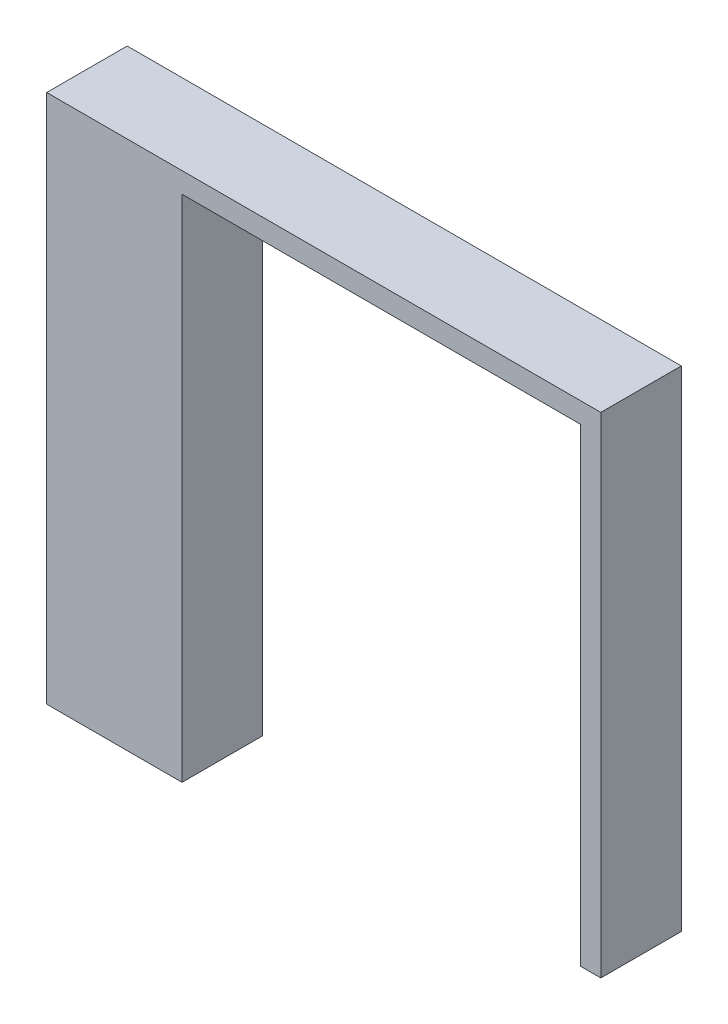
ISO-10303-21;
HEADER;
FILE_DESCRIPTION(('STEP AP214'),'2;1');
FILE_NAME('part.step','',(''),(''),'','','');
FILE_SCHEMA(('AUTOMOTIVE_DESIGN { 1 0 10303 214 1 1 1 1 }'));
ENDSEC;
DATA;
#1=APPLICATION_CONTEXT('core data for automotive mechanical design processes');
#2=APPLICATION_PROTOCOL_DEFINITION('international standard','automotive_design',2000,#1);
#3=PRODUCT_CONTEXT('',#1,'mechanical');
#4=PRODUCT('Part','Part','',(#3));
#5=PRODUCT_RELATED_PRODUCT_CATEGORY('part','',(#4));
#6=PRODUCT_DEFINITION_FORMATION('','',#4);
#7=PRODUCT_DEFINITION_CONTEXT('part definition',#1,'design');
#8=PRODUCT_DEFINITION('design','',#6,#7);
#9=PRODUCT_DEFINITION_SHAPE('','',#8);
#10=(LENGTH_UNIT() NAMED_UNIT(*) SI_UNIT(.MILLI.,.METRE.));
#11=(NAMED_UNIT(*) PLANE_ANGLE_UNIT() SI_UNIT($,.RADIAN.));
#12=(NAMED_UNIT(*) SI_UNIT($,.STERADIAN.) SOLID_ANGLE_UNIT());
#13=UNCERTAINTY_MEASURE_WITH_UNIT(LENGTH_MEASURE(1.E-05),#10,'distance_accuracy_value','');
#14=(GEOMETRIC_REPRESENTATION_CONTEXT(3) GLOBAL_UNCERTAINTY_ASSIGNED_CONTEXT((#13)) GLOBAL_UNIT_ASSIGNED_CONTEXT((#10,
#11,#12)) REPRESENTATION_CONTEXT('',''));
#15=CARTESIAN_POINT('',(0.,0.,0.));
#16=DIRECTION('',(0.,0.,1.));
#17=DIRECTION('',(1.,0.,0.));
#18=AXIS2_PLACEMENT_3D('',#15,#16,#17);
#19=CARTESIAN_POINT('',(7.2263,-5.8674,2.10000088));
#20=DIRECTION('',(0.,0.,-1.));
#21=DIRECTION('',(0.,-1.,0.));
#22=AXIS2_PLACEMENT_3D('',#19,#20,#21);
#23=PLANE('',#22);
#24=DIRECTION('',(0.,1.,0.));
#25=VECTOR('',#24,1.);
#26=CARTESIAN_POINT('',(7.2263,-5.8674,2.10000088));
#27=LINE('',#26,#25);
#28=CARTESIAN_POINT('',(7.2263,-5.8674,2.10000088));
#29=VERTEX_POINT('',#28);
#30=CARTESIAN_POINT('',(7.2263,6.9088,2.10000088));
#31=VERTEX_POINT('',#30);
#32=EDGE_CURVE('E147',#29,#31,#27,.T.);
#33=ORIENTED_EDGE('',*,*,#32,.T.);
#34=DIRECTION('',(-1.,0.,0.));
#35=VECTOR('',#34,1.);
#36=CARTESIAN_POINT('',(7.2263,6.9088,2.10000088));
#37=LINE('',#36,#35);
#38=CARTESIAN_POINT('',(-7.2263,6.9088,2.10000088));
#39=VERTEX_POINT('',#38);
#40=EDGE_CURVE('E137',#31,#39,#37,.T.);
#41=ORIENTED_EDGE('',*,*,#40,.T.);
#42=DIRECTION('',(0.,-1.,0.));
#43=VECTOR('',#42,1.);
#44=CARTESIAN_POINT('',(-7.2263,6.9088,2.10000088));
#45=LINE('',#44,#43);
#46=CARTESIAN_POINT('',(-7.2263,-6.9088,2.10000088));
#47=VERTEX_POINT('',#46);
#48=EDGE_CURVE('E129',#39,#47,#45,.T.);
#49=ORIENTED_EDGE('',*,*,#48,.T.);
#50=DIRECTION('',(1.,0.,0.));
#51=VECTOR('',#50,1.);
#52=CARTESIAN_POINT('',(-7.2263,-6.9088,2.10000088));
#53=LINE('',#52,#51);
#54=CARTESIAN_POINT('',(-3.6957,-6.9088,2.10000088));
#55=VERTEX_POINT('',#54);
#56=EDGE_CURVE('E134',#47,#55,#53,.T.);
#57=ORIENTED_EDGE('',*,*,#56,.T.);
#58=DIRECTION('',(0.,1.,0.));
#59=VECTOR('',#58,1.);
#60=CARTESIAN_POINT('',(-3.6957,-6.9088,2.10000088));
#61=LINE('',#60,#59);
#62=CARTESIAN_POINT('',(-3.6957,6.3754,2.10000088));
#63=VERTEX_POINT('',#62);
#64=EDGE_CURVE('E119',#55,#63,#61,.T.);
#65=ORIENTED_EDGE('',*,*,#64,.T.);
#66=DIRECTION('',(1.,0.,0.));
#67=VECTOR('',#66,1.);
#68=CARTESIAN_POINT('',(-3.6957,6.3754,2.10000088));
#69=LINE('',#68,#67);
#70=CARTESIAN_POINT('',(6.6929,6.3754,2.10000088));
#71=VERTEX_POINT('',#70);
#72=EDGE_CURVE('E105',#63,#71,#69,.T.);
#73=ORIENTED_EDGE('',*,*,#72,.T.);
#74=DIRECTION('',(0.,-1.,0.));
#75=VECTOR('',#74,1.);
#76=CARTESIAN_POINT('',(6.6929,6.3754,2.10000088));
#77=LINE('',#76,#75);
#78=CARTESIAN_POINT('',(6.6929,-5.8674,2.10000088));
#79=VERTEX_POINT('',#78);
#80=EDGE_CURVE('E109',#71,#79,#77,.T.);
#81=ORIENTED_EDGE('',*,*,#80,.T.);
#82=DIRECTION('',(1.,0.,0.));
#83=VECTOR('',#82,1.);
#84=CARTESIAN_POINT('',(6.6929,-5.8674,2.10000088));
#85=LINE('',#84,#83);
#86=EDGE_CURVE('E11',#79,#29,#85,.T.);
#87=ORIENTED_EDGE('',*,*,#86,.T.);
#88=EDGE_LOOP('',(#33,#41,#49,#57,#65,#73,#81,#87));
#89=FACE_BOUND('',#88,.T.);
#90=ADVANCED_FACE('F17',(#89),#23,.F.);
#91=CARTESIAN_POINT('',(7.2263,-5.8674,0.));
#92=DIRECTION('',(0.,0.,-1.));
#93=DIRECTION('',(0.,-1.,0.));
#94=AXIS2_PLACEMENT_3D('',#91,#92,#93);
#95=PLANE('',#94);
#96=DIRECTION('',(0.,1.,0.));
#97=VECTOR('',#96,1.);
#98=CARTESIAN_POINT('',(7.2263,-5.8674,0.));
#99=LINE('',#98,#97);
#100=CARTESIAN_POINT('',(7.2263,-5.8674,0.));
#101=VERTEX_POINT('',#100);
#102=CARTESIAN_POINT('',(7.2263,6.9088,0.));
#103=VERTEX_POINT('',#102);
#104=EDGE_CURVE('E148',#101,#103,#99,.T.);
#105=ORIENTED_EDGE('',*,*,#104,.F.);
#106=DIRECTION('',(1.,0.,0.));
#107=VECTOR('',#106,1.);
#108=CARTESIAN_POINT('',(6.6929,-5.8674,0.));
#109=LINE('',#108,#107);
#110=CARTESIAN_POINT('',(6.6929,-5.8674,0.));
#111=VERTEX_POINT('',#110);
#112=EDGE_CURVE('E28',#111,#101,#109,.T.);
#113=ORIENTED_EDGE('',*,*,#112,.F.);
#114=DIRECTION('',(0.,-1.,0.));
#115=VECTOR('',#114,1.);
#116=CARTESIAN_POINT('',(6.6929,6.3754,0.));
#117=LINE('',#116,#115);
#118=CARTESIAN_POINT('',(6.6929,6.3754,0.));
#119=VERTEX_POINT('',#118);
#120=EDGE_CURVE('E95',#119,#111,#117,.T.);
#121=ORIENTED_EDGE('',*,*,#120,.F.);
#122=DIRECTION('',(1.,0.,0.));
#123=VECTOR('',#122,1.);
#124=CARTESIAN_POINT('',(-3.6957,6.3754,0.));
#125=LINE('',#124,#123);
#126=CARTESIAN_POINT('',(-3.6957,6.3754,0.));
#127=VERTEX_POINT('',#126);
#128=EDGE_CURVE('E100',#127,#119,#125,.T.);
#129=ORIENTED_EDGE('',*,*,#128,.F.);
#130=DIRECTION('',(0.,1.,0.));
#131=VECTOR('',#130,1.);
#132=CARTESIAN_POINT('',(-3.6957,-6.9088,0.));
#133=LINE('',#132,#131);
#134=CARTESIAN_POINT('',(-3.6957,-6.9088,0.));
#135=VERTEX_POINT('',#134);
#136=EDGE_CURVE('E166',#135,#127,#133,.T.);
#137=ORIENTED_EDGE('',*,*,#136,.F.);
#138=DIRECTION('',(1.,0.,0.));
#139=VECTOR('',#138,1.);
#140=CARTESIAN_POINT('',(-7.2263,-6.9088,0.));
#141=LINE('',#140,#139);
#142=CARTESIAN_POINT('',(-7.2263,-6.9088,0.));
#143=VERTEX_POINT('',#142);
#144=EDGE_CURVE('E135',#143,#135,#141,.T.);
#145=ORIENTED_EDGE('',*,*,#144,.F.);
#146=DIRECTION('',(0.,-1.,0.));
#147=VECTOR('',#146,1.);
#148=CARTESIAN_POINT('',(-7.2263,6.9088,0.));
#149=LINE('',#148,#147);
#150=CARTESIAN_POINT('',(-7.2263,6.9088,0.));
#151=VERTEX_POINT('',#150);
#152=EDGE_CURVE('E141',#151,#143,#149,.T.);
#153=ORIENTED_EDGE('',*,*,#152,.F.);
#154=DIRECTION('',(-1.,0.,0.));
#155=VECTOR('',#154,1.);
#156=CARTESIAN_POINT('',(7.2263,6.9088,0.));
#157=LINE('',#156,#155);
#158=EDGE_CURVE('E158',#103,#151,#157,.T.);
#159=ORIENTED_EDGE('',*,*,#158,.F.);
#160=EDGE_LOOP('',(#105,#113,#121,#129,#137,#145,#153,#159));
#161=FACE_BOUND('',#160,.T.);
#162=ADVANCED_FACE('F98',(#161),#95,.T.);
#163=CARTESIAN_POINT('',(6.6929,-5.8674,0.));
#164=DIRECTION('',(0.,1.,0.));
#165=DIRECTION('',(1.,0.,0.));
#166=AXIS2_PLACEMENT_3D('',#163,#164,#165);
#167=PLANE('',#166);
#168=DIRECTION('',(0.,0.,1.));
#169=VECTOR('',#168,1.);
#170=CARTESIAN_POINT('',(6.6929,-5.8674,0.));
#171=LINE('',#170,#169);
#172=EDGE_CURVE('E21',#111,#79,#171,.T.);
#173=ORIENTED_EDGE('',*,*,#172,.F.);
#174=ORIENTED_EDGE('',*,*,#112,.T.);
#175=DIRECTION('',(0.,0.,1.));
#176=VECTOR('',#175,1.);
#177=CARTESIAN_POINT('',(7.2263,-5.8674,0.));
#178=LINE('',#177,#176);
#179=EDGE_CURVE('E154',#101,#29,#178,.T.);
#180=ORIENTED_EDGE('',*,*,#179,.T.);
#181=ORIENTED_EDGE('',*,*,#86,.F.);
#182=EDGE_LOOP('',(#173,#174,#180,#181));
#183=FACE_BOUND('',#182,.T.);
#184=ADVANCED_FACE('F188',(#183),#167,.F.);
#185=CARTESIAN_POINT('',(6.6929,6.3754,0.));
#186=DIRECTION('',(1.,0.,0.));
#187=DIRECTION('',(0.,1.,0.));
#188=AXIS2_PLACEMENT_3D('',#185,#186,#187);
#189=PLANE('',#188);
#190=DIRECTION('',(0.,0.,1.));
#191=VECTOR('',#190,1.);
#192=CARTESIAN_POINT('',(6.6929,6.3754,0.));
#193=LINE('',#192,#191);
#194=EDGE_CURVE('E108',#119,#71,#193,.T.);
#195=ORIENTED_EDGE('',*,*,#194,.F.);
#196=ORIENTED_EDGE('',*,*,#120,.T.);
#197=ORIENTED_EDGE('',*,*,#172,.T.);
#198=ORIENTED_EDGE('',*,*,#80,.F.);
#199=EDGE_LOOP('',(#195,#196,#197,#198));
#200=FACE_BOUND('',#199,.T.);
#201=ADVANCED_FACE('F19',(#200),#189,.F.);
#202=CARTESIAN_POINT('',(-3.6957,6.3754,0.));
#203=DIRECTION('',(0.,1.,0.));
#204=DIRECTION('',(1.,0.,0.));
#205=AXIS2_PLACEMENT_3D('',#202,#203,#204);
#206=PLANE('',#205);
#207=DIRECTION('',(0.,0.,1.));
#208=VECTOR('',#207,1.);
#209=CARTESIAN_POINT('',(-3.6957,6.3754,0.));
#210=LINE('',#209,#208);
#211=EDGE_CURVE('E116',#127,#63,#210,.T.);
#212=ORIENTED_EDGE('',*,*,#211,.F.);
#213=ORIENTED_EDGE('',*,*,#128,.T.);
#214=ORIENTED_EDGE('',*,*,#194,.T.);
#215=ORIENTED_EDGE('',*,*,#72,.F.);
#216=EDGE_LOOP('',(#212,#213,#214,#215));
#217=FACE_BOUND('',#216,.T.);
#218=ADVANCED_FACE('F114',(#217),#206,.F.);
#219=CARTESIAN_POINT('',(-3.6957,-6.9088,0.));
#220=DIRECTION('',(-1.,0.,0.));
#221=DIRECTION('',(0.,0.,1.));
#222=AXIS2_PLACEMENT_3D('',#219,#220,#221);
#223=PLANE('',#222);
#224=DIRECTION('',(0.,0.,1.));
#225=VECTOR('',#224,1.);
#226=CARTESIAN_POINT('',(-3.6957,-6.9088,0.));
#227=LINE('',#226,#225);
#228=EDGE_CURVE('E131',#135,#55,#227,.T.);
#229=ORIENTED_EDGE('',*,*,#228,.F.);
#230=ORIENTED_EDGE('',*,*,#136,.T.);
#231=ORIENTED_EDGE('',*,*,#211,.T.);
#232=ORIENTED_EDGE('',*,*,#64,.F.);
#233=EDGE_LOOP('',(#229,#230,#231,#232));
#234=FACE_BOUND('',#233,.T.);
#235=ADVANCED_FACE('F225',(#234),#223,.F.);
#236=CARTESIAN_POINT('',(-7.2263,-6.9088,0.));
#237=DIRECTION('',(0.,1.,0.));
#238=DIRECTION('',(1.,0.,0.));
#239=AXIS2_PLACEMENT_3D('',#236,#237,#238);
#240=PLANE('',#239);
#241=DIRECTION('',(0.,0.,1.));
#242=VECTOR('',#241,1.);
#243=CARTESIAN_POINT('',(-7.2263,-6.9088,0.));
#244=LINE('',#243,#242);
#245=EDGE_CURVE('E165',#143,#47,#244,.T.);
#246=ORIENTED_EDGE('',*,*,#245,.F.);
#247=ORIENTED_EDGE('',*,*,#144,.T.);
#248=ORIENTED_EDGE('',*,*,#228,.T.);
#249=ORIENTED_EDGE('',*,*,#56,.F.);
#250=EDGE_LOOP('',(#246,#247,#248,#249));
#251=FACE_BOUND('',#250,.T.);
#252=ADVANCED_FACE('F221',(#251),#240,.F.);
#253=CARTESIAN_POINT('',(-7.2263,6.9088,0.));
#254=DIRECTION('',(1.,0.,0.));
#255=DIRECTION('',(0.,1.,0.));
#256=AXIS2_PLACEMENT_3D('',#253,#254,#255);
#257=PLANE('',#256);
#258=DIRECTION('',(0.,0.,1.));
#259=VECTOR('',#258,1.);
#260=CARTESIAN_POINT('',(-7.2263,6.9088,0.));
#261=LINE('',#260,#259);
#262=EDGE_CURVE('E142',#151,#39,#261,.T.);
#263=ORIENTED_EDGE('',*,*,#262,.F.);
#264=ORIENTED_EDGE('',*,*,#152,.T.);
#265=ORIENTED_EDGE('',*,*,#245,.T.);
#266=ORIENTED_EDGE('',*,*,#48,.F.);
#267=EDGE_LOOP('',(#263,#264,#265,#266));
#268=FACE_BOUND('',#267,.T.);
#269=ADVANCED_FACE('F220',(#268),#257,.F.);
#270=CARTESIAN_POINT('',(7.2263,6.9088,0.));
#271=DIRECTION('',(0.,-1.,0.));
#272=DIRECTION('',(0.,0.,-1.));
#273=AXIS2_PLACEMENT_3D('',#270,#271,#272);
#274=PLANE('',#273);
#275=DIRECTION('',(0.,0.,1.));
#276=VECTOR('',#275,1.);
#277=CARTESIAN_POINT('',(7.2263,6.9088,0.));
#278=LINE('',#277,#276);
#279=EDGE_CURVE('E143',#103,#31,#278,.T.);
#280=ORIENTED_EDGE('',*,*,#279,.F.);
#281=ORIENTED_EDGE('',*,*,#158,.T.);
#282=ORIENTED_EDGE('',*,*,#262,.T.);
#283=ORIENTED_EDGE('',*,*,#40,.F.);
#284=EDGE_LOOP('',(#280,#281,#282,#283));
#285=FACE_BOUND('',#284,.T.);
#286=ADVANCED_FACE('F175',(#285),#274,.F.);
#287=CARTESIAN_POINT('',(7.2263,-5.8674,0.));
#288=DIRECTION('',(-1.,0.,0.));
#289=DIRECTION('',(0.,0.,1.));
#290=AXIS2_PLACEMENT_3D('',#287,#288,#289);
#291=PLANE('',#290);
#292=ORIENTED_EDGE('',*,*,#179,.F.);
#293=ORIENTED_EDGE('',*,*,#104,.T.);
#294=ORIENTED_EDGE('',*,*,#279,.T.);
#295=ORIENTED_EDGE('',*,*,#32,.F.);
#296=EDGE_LOOP('',(#292,#293,#294,#295));
#297=FACE_BOUND('',#296,.T.);
#298=ADVANCED_FACE('F187',(#297),#291,.F.);
#299=CLOSED_SHELL('',(#90,#162,#184,#201,#218,#235,#252,#269,#286,#298));
#300=MANIFOLD_SOLID_BREP('B1',#299);
#301=ADVANCED_BREP_SHAPE_REPRESENTATION('',(#18,#300),#14);
#302=SHAPE_DEFINITION_REPRESENTATION(#9,#301);
ENDSEC;
END-ISO-10303-21;
